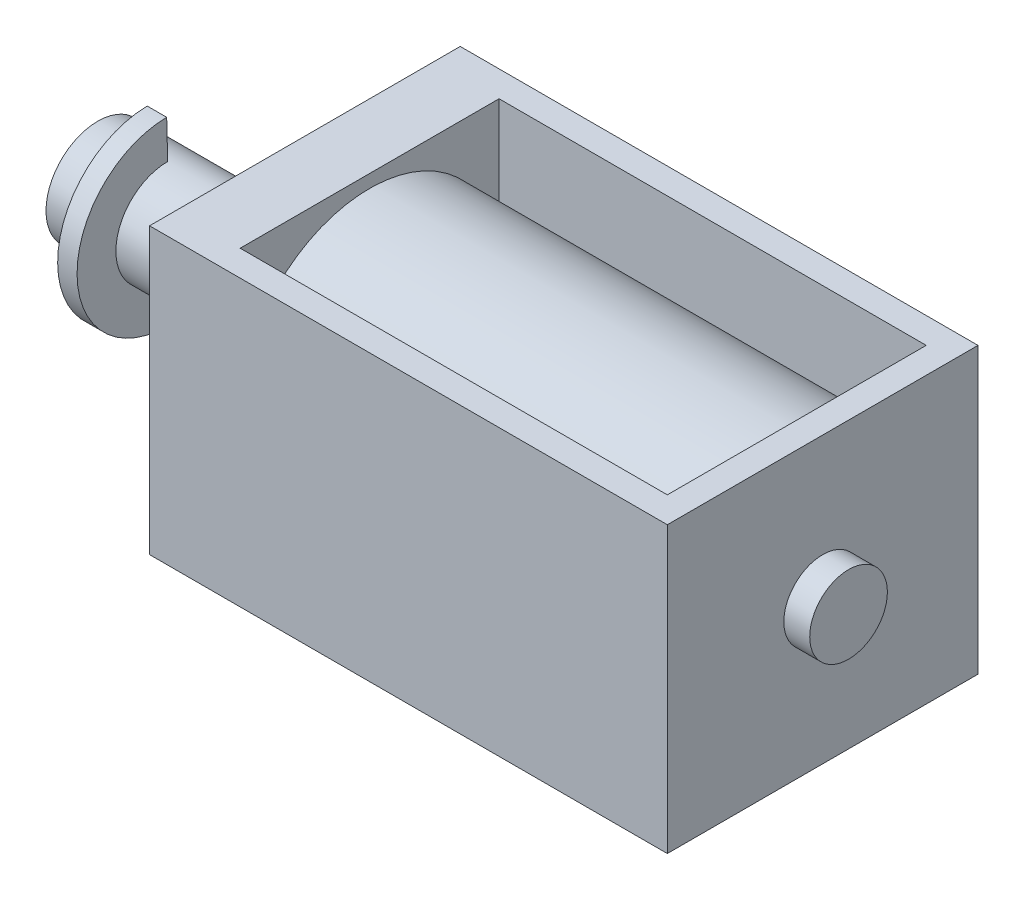
ISO-10303-21;
HEADER;
FILE_DESCRIPTION(('STEP AP214'),'2;1');
FILE_NAME('part.step','',(''),(''),'','','');
FILE_SCHEMA(('AUTOMOTIVE_DESIGN { 1 0 10303 214 1 1 1 1 }'));
ENDSEC;
DATA;
#1=APPLICATION_CONTEXT('core data for automotive mechanical design processes');
#2=APPLICATION_PROTOCOL_DEFINITION('international standard','automotive_design',2000,#1);
#3=PRODUCT_CONTEXT('',#1,'mechanical');
#4=PRODUCT('Part','Part','',(#3));
#5=PRODUCT_RELATED_PRODUCT_CATEGORY('part','',(#4));
#6=PRODUCT_DEFINITION_FORMATION('','',#4);
#7=PRODUCT_DEFINITION_CONTEXT('part definition',#1,'design');
#8=PRODUCT_DEFINITION('design','',#6,#7);
#9=PRODUCT_DEFINITION_SHAPE('','',#8);
#10=(LENGTH_UNIT() NAMED_UNIT(*) SI_UNIT(.MILLI.,.METRE.));
#11=(NAMED_UNIT(*) PLANE_ANGLE_UNIT() SI_UNIT($,.RADIAN.));
#12=(NAMED_UNIT(*) SI_UNIT($,.STERADIAN.) SOLID_ANGLE_UNIT());
#13=UNCERTAINTY_MEASURE_WITH_UNIT(LENGTH_MEASURE(1.E-05),#10,'distance_accuracy_value','');
#14=(GEOMETRIC_REPRESENTATION_CONTEXT(3) GLOBAL_UNCERTAINTY_ASSIGNED_CONTEXT((#13)) GLOBAL_UNIT_ASSIGNED_CONTEXT((#10,
#11,#12)) REPRESENTATION_CONTEXT('',''));
#15=CARTESIAN_POINT('',(0.,0.,0.));
#16=DIRECTION('',(0.,0.,1.));
#17=DIRECTION('',(1.,0.,0.));
#18=AXIS2_PLACEMENT_3D('',#15,#16,#17);
#19=CARTESIAN_POINT('',(19.,0.,-11.));
#20=DIRECTION('',(1.,0.,0.));
#21=DIRECTION('',(0.,0.,-1.));
#22=AXIS2_PLACEMENT_3D('',#19,#20,#21);
#23=PLANE('',#22);
#24=CARTESIAN_POINT('',(19.0000000000055,5.5,-6.));
#25=DIRECTION('',(1.,0.,0.));
#26=DIRECTION('',(0.,0.,-1.));
#27=AXIS2_PLACEMENT_3D('',#24,#25,#26);
#28=CIRCLE('',#27,5.);
#29=CARTESIAN_POINT('',(19.0000000000055,5.5,-11.));
#30=VERTEX_POINT('',#29);
#31=EDGE_CURVE('E11',#30,#30,#28,.T.);
#32=ORIENTED_EDGE('',*,*,#31,.T.);
#33=EDGE_LOOP('',(#32));
#34=FACE_BOUND('',#33,.T.);
#35=ADVANCED_FACE('F47',(#34),#23,.T.);
#36=CARTESIAN_POINT('',(2.5,5.5,-6.));
#37=DIRECTION('',(1.,0.,0.));
#38=DIRECTION('',(0.,0.,-1.));
#39=AXIS2_PLACEMENT_3D('',#36,#37,#38);
#40=PLANE('',#39);
#41=CARTESIAN_POINT('',(2.5,5.5,-6.));
#42=DIRECTION('',(1.,0.,0.));
#43=DIRECTION('',(0.,0.,-1.));
#44=AXIS2_PLACEMENT_3D('',#41,#42,#43);
#45=CIRCLE('',#44,5.);
#46=CARTESIAN_POINT('',(2.5,5.5,-11.));
#47=VERTEX_POINT('',#46);
#48=EDGE_CURVE('E53',#47,#47,#45,.T.);
#49=ORIENTED_EDGE('',*,*,#48,.F.);
#50=EDGE_LOOP('',(#49));
#51=FACE_BOUND('',#50,.T.);
#52=ADVANCED_FACE('F63',(#51),#40,.F.);
#53=CARTESIAN_POINT('',(500000.,5.5,-6.00000000006505));
#54=DIRECTION('',(-1.,0.,0.));
#55=DIRECTION('',(0.,0.,1.));
#56=AXIS2_PLACEMENT_3D('',#53,#54,#55);
#57=CYLINDRICAL_SURFACE('',#56,5.);
#58=ORIENTED_EDGE('',*,*,#48,.T.);
#59=EDGE_LOOP('',(#58));
#60=FACE_BOUND('',#59,.T.);
#61=ORIENTED_EDGE('',*,*,#31,.F.);
#62=EDGE_LOOP('',(#61));
#63=FACE_BOUND('',#62,.T.);
#64=ADVANCED_FACE('F60',(#60,#63),#57,.T.);
#65=CLOSED_SHELL('',(#35,#52,#64));
#66=MANIFOLD_SOLID_BREP('B2',#65);
#67=CARTESIAN_POINT('',(20.,11.,0.));
#68=DIRECTION('',(-1.,0.,0.));
#69=DIRECTION('',(0.,0.,1.));
#70=AXIS2_PLACEMENT_3D('',#67,#68,#69);
#71=PLANE('',#70);
#72=DIRECTION('',(0.,0.,-1.));
#73=VECTOR('',#72,1.);
#74=CARTESIAN_POINT('',(20.,0.,0.));
#75=LINE('',#74,#73);
#76=CARTESIAN_POINT('',(20.,0.,0.));
#77=VERTEX_POINT('',#76);
#78=CARTESIAN_POINT('',(20.,0.,-12.));
#79=VERTEX_POINT('',#78);
#80=EDGE_CURVE('E307',#77,#79,#75,.T.);
#81=ORIENTED_EDGE('',*,*,#80,.T.);
#82=DIRECTION('',(0.,-1.,0.));
#83=VECTOR('',#82,1.);
#84=CARTESIAN_POINT('',(20.,11.,-12.));
#85=LINE('',#84,#83);
#86=CARTESIAN_POINT('',(20.,11.,-12.));
#87=VERTEX_POINT('',#86);
#88=EDGE_CURVE('E313',#87,#79,#85,.T.);
#89=ORIENTED_EDGE('',*,*,#88,.F.);
#90=DIRECTION('',(0.,0.,-1.));
#91=VECTOR('',#90,1.);
#92=CARTESIAN_POINT('',(20.,11.,0.));
#93=LINE('',#92,#91);
#94=CARTESIAN_POINT('',(20.,11.,0.));
#95=VERTEX_POINT('',#94);
#96=EDGE_CURVE('E294',#95,#87,#93,.T.);
#97=ORIENTED_EDGE('',*,*,#96,.F.);
#98=DIRECTION('',(0.,-1.,0.));
#99=VECTOR('',#98,1.);
#100=CARTESIAN_POINT('',(20.,11.,0.));
#101=LINE('',#100,#99);
#102=EDGE_CURVE('E316',#95,#77,#101,.T.);
#103=ORIENTED_EDGE('',*,*,#102,.T.);
#104=EDGE_LOOP('',(#81,#89,#97,#103));
#105=FACE_BOUND('',#104,.T.);
#106=CARTESIAN_POINT('',(20.,5.5,-6.));
#107=DIRECTION('',(-1.,0.,0.));
#108=DIRECTION('',(0.,0.,1.));
#109=AXIS2_PLACEMENT_3D('',#106,#107,#108);
#110=CIRCLE('',#109,1.5);
#111=CARTESIAN_POINT('',(20.,5.5,-4.5));
#112=VERTEX_POINT('',#111);
#113=EDGE_CURVE('E45',#112,#112,#110,.F.);
#114=ORIENTED_EDGE('',*,*,#113,.F.);
#115=EDGE_LOOP('',(#114));
#116=FACE_BOUND('',#115,.T.);
#117=ADVANCED_FACE('F91',(#105,#116),#71,.F.);
#118=CARTESIAN_POINT('',(0.,11.,0.));
#119=DIRECTION('',(1.,0.,0.));
#120=DIRECTION('',(0.,0.,-1.));
#121=AXIS2_PLACEMENT_3D('',#118,#119,#120);
#122=PLANE('',#121);
#123=DIRECTION('',(0.,0.,1.));
#124=VECTOR('',#123,1.);
#125=CARTESIAN_POINT('',(0.,0.,0.));
#126=LINE('',#125,#124);
#127=CARTESIAN_POINT('',(0.,0.,-12.));
#128=VERTEX_POINT('',#127);
#129=CARTESIAN_POINT('',(0.,0.,0.));
#130=VERTEX_POINT('',#129);
#131=EDGE_CURVE('E277',#128,#130,#126,.T.);
#132=ORIENTED_EDGE('',*,*,#131,.T.);
#133=DIRECTION('',(0.,-1.,0.));
#134=VECTOR('',#133,1.);
#135=CARTESIAN_POINT('',(0.,11.,0.));
#136=LINE('',#135,#134);
#137=CARTESIAN_POINT('',(0.,11.,0.));
#138=VERTEX_POINT('',#137);
#139=EDGE_CURVE('E319',#138,#130,#136,.T.);
#140=ORIENTED_EDGE('',*,*,#139,.F.);
#141=DIRECTION('',(0.,0.,1.));
#142=VECTOR('',#141,1.);
#143=CARTESIAN_POINT('',(0.,11.,0.));
#144=LINE('',#143,#142);
#145=CARTESIAN_POINT('',(0.,11.,-12.));
#146=VERTEX_POINT('',#145);
#147=EDGE_CURVE('E286',#146,#138,#144,.T.);
#148=ORIENTED_EDGE('',*,*,#147,.F.);
#149=DIRECTION('',(0.,-1.,0.));
#150=VECTOR('',#149,1.);
#151=CARTESIAN_POINT('',(0.,11.,-12.));
#152=LINE('',#151,#150);
#153=EDGE_CURVE('E300',#146,#128,#152,.T.);
#154=ORIENTED_EDGE('',*,*,#153,.T.);
#155=EDGE_LOOP('',(#132,#140,#148,#154));
#156=FACE_BOUND('',#155,.T.);
#157=CARTESIAN_POINT('',(0.,5.5,-6.));
#158=DIRECTION('',(1.,0.,0.));
#159=DIRECTION('',(0.,0.,-1.));
#160=AXIS2_PLACEMENT_3D('',#157,#158,#159);
#161=CIRCLE('',#160,2.);
#162=CARTESIAN_POINT('',(0.,5.5,-8.));
#163=VERTEX_POINT('',#162);
#164=EDGE_CURVE('E99',#163,#163,#161,.F.);
#165=ORIENTED_EDGE('',*,*,#164,.F.);
#166=EDGE_LOOP('',(#165));
#167=FACE_BOUND('',#166,.T.);
#168=ADVANCED_FACE('F93',(#156,#167),#122,.F.);
#169=CARTESIAN_POINT('',(0.,11.,0.));
#170=DIRECTION('',(0.,0.,-1.));
#171=DIRECTION('',(-1.,0.,0.));
#172=AXIS2_PLACEMENT_3D('',#169,#170,#171);
#173=PLANE('',#172);
#174=DIRECTION('',(1.,0.,0.));
#175=VECTOR('',#174,1.);
#176=CARTESIAN_POINT('',(0.,0.,0.));
#177=LINE('',#176,#175);
#178=EDGE_CURVE('E304',#130,#77,#177,.T.);
#179=ORIENTED_EDGE('',*,*,#178,.T.);
#180=ORIENTED_EDGE('',*,*,#102,.F.);
#181=DIRECTION('',(1.,0.,0.));
#182=VECTOR('',#181,1.);
#183=CARTESIAN_POINT('',(0.,11.,0.));
#184=LINE('',#183,#182);
#185=EDGE_CURVE('E290',#138,#95,#184,.T.);
#186=ORIENTED_EDGE('',*,*,#185,.F.);
#187=ORIENTED_EDGE('',*,*,#139,.T.);
#188=EDGE_LOOP('',(#179,#180,#186,#187));
#189=FACE_BOUND('',#188,.T.);
#190=ADVANCED_FACE('F329',(#189),#173,.F.);
#191=CARTESIAN_POINT('',(0.,11.,-12.));
#192=DIRECTION('',(0.,0.,1.));
#193=DIRECTION('',(1.,0.,0.));
#194=AXIS2_PLACEMENT_3D('',#191,#192,#193);
#195=PLANE('',#194);
#196=DIRECTION('',(-1.,0.,0.));
#197=VECTOR('',#196,1.);
#198=CARTESIAN_POINT('',(0.,0.,-12.));
#199=LINE('',#198,#197);
#200=EDGE_CURVE('E291',#79,#128,#199,.T.);
#201=ORIENTED_EDGE('',*,*,#200,.T.);
#202=ORIENTED_EDGE('',*,*,#153,.F.);
#203=DIRECTION('',(-1.,0.,0.));
#204=VECTOR('',#203,1.);
#205=CARTESIAN_POINT('',(0.,11.,-12.));
#206=LINE('',#205,#204);
#207=EDGE_CURVE('E297',#87,#146,#206,.T.);
#208=ORIENTED_EDGE('',*,*,#207,.F.);
#209=ORIENTED_EDGE('',*,*,#88,.T.);
#210=EDGE_LOOP('',(#201,#202,#208,#209));
#211=FACE_BOUND('',#210,.T.);
#212=ADVANCED_FACE('F335',(#211),#195,.F.);
#213=CARTESIAN_POINT('',(0.,11.,0.));
#214=DIRECTION('',(0.,-1.,0.));
#215=DIRECTION('',(0.,0.,-1.));
#216=AXIS2_PLACEMENT_3D('',#213,#214,#215);
#217=PLANE('',#216);
#218=DIRECTION('',(1.,0.,0.));
#219=VECTOR('',#218,1.);
#220=CARTESIAN_POINT('',(2.5,11.,-1.));
#221=LINE('',#220,#219);
#222=CARTESIAN_POINT('',(2.5,11.,-1.));
#223=VERTEX_POINT('',#222);
#224=CARTESIAN_POINT('',(19.,11.,-1.));
#225=VERTEX_POINT('',#224);
#226=EDGE_CURVE('E263',#223,#225,#221,.T.);
#227=ORIENTED_EDGE('',*,*,#226,.F.);
#228=DIRECTION('',(0.,0.,1.));
#229=VECTOR('',#228,1.);
#230=CARTESIAN_POINT('',(2.5,11.,-11.));
#231=LINE('',#230,#229);
#232=CARTESIAN_POINT('',(2.5,11.,-11.));
#233=VERTEX_POINT('',#232);
#234=EDGE_CURVE('E246',#233,#223,#231,.T.);
#235=ORIENTED_EDGE('',*,*,#234,.F.);
#236=DIRECTION('',(-1.,0.,0.));
#237=VECTOR('',#236,1.);
#238=CARTESIAN_POINT('',(2.5,11.,-11.));
#239=LINE('',#238,#237);
#240=CARTESIAN_POINT('',(19.,11.,-11.));
#241=VERTEX_POINT('',#240);
#242=EDGE_CURVE('E251',#241,#233,#239,.T.);
#243=ORIENTED_EDGE('',*,*,#242,.F.);
#244=DIRECTION('',(0.,0.,-1.));
#245=VECTOR('',#244,1.);
#246=CARTESIAN_POINT('',(19.,11.,-11.));
#247=LINE('',#246,#245);
#248=EDGE_CURVE('E267',#225,#241,#247,.T.);
#249=ORIENTED_EDGE('',*,*,#248,.F.);
#250=EDGE_LOOP('',(#227,#235,#243,#249));
#251=FACE_BOUND('',#250,.T.);
#252=ORIENTED_EDGE('',*,*,#147,.T.);
#253=ORIENTED_EDGE('',*,*,#185,.T.);
#254=ORIENTED_EDGE('',*,*,#96,.T.);
#255=ORIENTED_EDGE('',*,*,#207,.T.);
#256=EDGE_LOOP('',(#252,#253,#254,#255));
#257=FACE_BOUND('',#256,.T.);
#258=ADVANCED_FACE('F350',(#251,#257),#217,.F.);
#259=CARTESIAN_POINT('',(0.,0.,0.));
#260=DIRECTION('',(0.,-1.,0.));
#261=DIRECTION('',(0.,0.,-1.));
#262=AXIS2_PLACEMENT_3D('',#259,#260,#261);
#263=PLANE('',#262);
#264=DIRECTION('',(0.,0.,1.));
#265=VECTOR('',#264,1.);
#266=CARTESIAN_POINT('',(2.5,0.,-11.));
#267=LINE('',#266,#265);
#268=CARTESIAN_POINT('',(2.5,0.,-11.));
#269=VERTEX_POINT('',#268);
#270=CARTESIAN_POINT('',(2.5,0.,-1.));
#271=VERTEX_POINT('',#270);
#272=EDGE_CURVE('E247',#269,#271,#267,.T.);
#273=ORIENTED_EDGE('',*,*,#272,.T.);
#274=DIRECTION('',(1.,0.,0.));
#275=VECTOR('',#274,1.);
#276=CARTESIAN_POINT('',(2.5,0.,-1.));
#277=LINE('',#276,#275);
#278=CARTESIAN_POINT('',(19.,0.,-1.));
#279=VERTEX_POINT('',#278);
#280=EDGE_CURVE('E250',#271,#279,#277,.T.);
#281=ORIENTED_EDGE('',*,*,#280,.T.);
#282=DIRECTION('',(0.,0.,-1.));
#283=VECTOR('',#282,1.);
#284=CARTESIAN_POINT('',(19.,0.,-11.));
#285=LINE('',#284,#283);
#286=CARTESIAN_POINT('',(19.,0.,-11.));
#287=VERTEX_POINT('',#286);
#288=EDGE_CURVE('E254',#279,#287,#285,.T.);
#289=ORIENTED_EDGE('',*,*,#288,.T.);
#290=DIRECTION('',(-1.,0.,0.));
#291=VECTOR('',#290,1.);
#292=CARTESIAN_POINT('',(2.5,0.,-11.));
#293=LINE('',#292,#291);
#294=EDGE_CURVE('E257',#287,#269,#293,.T.);
#295=ORIENTED_EDGE('',*,*,#294,.T.);
#296=EDGE_LOOP('',(#273,#281,#289,#295));
#297=FACE_BOUND('',#296,.T.);
#298=ORIENTED_EDGE('',*,*,#131,.F.);
#299=ORIENTED_EDGE('',*,*,#200,.F.);
#300=ORIENTED_EDGE('',*,*,#80,.F.);
#301=ORIENTED_EDGE('',*,*,#178,.F.);
#302=EDGE_LOOP('',(#298,#299,#300,#301));
#303=FACE_BOUND('',#302,.T.);
#304=ADVANCED_FACE('F345',(#297,#303),#263,.T.);
#305=CARTESIAN_POINT('',(2.5,0.,-11.));
#306=DIRECTION('',(-1.,0.,0.));
#307=DIRECTION('',(0.,0.,1.));
#308=AXIS2_PLACEMENT_3D('',#305,#306,#307);
#309=PLANE('',#308);
#310=ORIENTED_EDGE('',*,*,#234,.T.);
#311=DIRECTION('',(0.,1.,0.));
#312=VECTOR('',#311,1.);
#313=CARTESIAN_POINT('',(2.5,0.,-1.));
#314=LINE('',#313,#312);
#315=EDGE_CURVE('E260',#271,#223,#314,.T.);
#316=ORIENTED_EDGE('',*,*,#315,.F.);
#317=ORIENTED_EDGE('',*,*,#272,.F.);
#318=DIRECTION('',(0.,1.,0.));
#319=VECTOR('',#318,1.);
#320=CARTESIAN_POINT('',(2.5,0.,-11.));
#321=LINE('',#320,#319);
#322=EDGE_CURVE('E274',#269,#233,#321,.T.);
#323=ORIENTED_EDGE('',*,*,#322,.T.);
#324=EDGE_LOOP('',(#310,#316,#317,#323));
#325=FACE_BOUND('',#324,.T.);
#326=ADVANCED_FACE('F381',(#325),#309,.F.);
#327=CARTESIAN_POINT('',(2.5,0.,-11.));
#328=DIRECTION('',(0.,0.,-1.));
#329=DIRECTION('',(-1.,0.,0.));
#330=AXIS2_PLACEMENT_3D('',#327,#328,#329);
#331=PLANE('',#330);
#332=ORIENTED_EDGE('',*,*,#242,.T.);
#333=ORIENTED_EDGE('',*,*,#322,.F.);
#334=ORIENTED_EDGE('',*,*,#294,.F.);
#335=DIRECTION('',(0.,1.,0.));
#336=VECTOR('',#335,1.);
#337=CARTESIAN_POINT('',(19.,0.,-11.));
#338=LINE('',#337,#336);
#339=EDGE_CURVE('E278',#287,#241,#338,.T.);
#340=ORIENTED_EDGE('',*,*,#339,.T.);
#341=EDGE_LOOP('',(#332,#333,#334,#340));
#342=FACE_BOUND('',#341,.T.);
#343=ADVANCED_FACE('F377',(#342),#331,.F.);
#344=CARTESIAN_POINT('',(19.,0.,-11.));
#345=DIRECTION('',(1.,0.,0.));
#346=DIRECTION('',(0.,0.,-1.));
#347=AXIS2_PLACEMENT_3D('',#344,#345,#346);
#348=PLANE('',#347);
#349=ORIENTED_EDGE('',*,*,#248,.T.);
#350=ORIENTED_EDGE('',*,*,#339,.F.);
#351=ORIENTED_EDGE('',*,*,#288,.F.);
#352=DIRECTION('',(0.,1.,0.));
#353=VECTOR('',#352,1.);
#354=CARTESIAN_POINT('',(19.,0.,-1.));
#355=LINE('',#354,#353);
#356=EDGE_CURVE('E281',#279,#225,#355,.T.);
#357=ORIENTED_EDGE('',*,*,#356,.T.);
#358=EDGE_LOOP('',(#349,#350,#351,#357));
#359=FACE_BOUND('',#358,.T.);
#360=ADVANCED_FACE('F380',(#359),#348,.F.);
#361=CARTESIAN_POINT('',(2.5,0.,-1.));
#362=DIRECTION('',(0.,0.,1.));
#363=DIRECTION('',(1.,0.,0.));
#364=AXIS2_PLACEMENT_3D('',#361,#362,#363);
#365=PLANE('',#364);
#366=ORIENTED_EDGE('',*,*,#226,.T.);
#367=ORIENTED_EDGE('',*,*,#356,.F.);
#368=ORIENTED_EDGE('',*,*,#280,.F.);
#369=ORIENTED_EDGE('',*,*,#315,.T.);
#370=EDGE_LOOP('',(#366,#367,#368,#369));
#371=FACE_BOUND('',#370,.T.);
#372=ADVANCED_FACE('F376',(#371),#365,.F.);
#373=CARTESIAN_POINT('',(-8.,5.5,-6.));
#374=DIRECTION('',(1.,0.,0.));
#375=DIRECTION('',(0.,0.,-1.));
#376=AXIS2_PLACEMENT_3D('',#373,#374,#375);
#377=CYLINDRICAL_SURFACE('',#376,2.);
#378=DIRECTION('',(1.,0.,0.));
#379=VECTOR('',#378,1.);
#380=CARTESIAN_POINT('',(-6.05,3.5,-6.));
#381=LINE('',#380,#379);
#382=CARTESIAN_POINT('',(-6.05,3.5,-6.));
#383=VERTEX_POINT('',#382);
#384=CARTESIAN_POINT('',(-5.3,3.5,-6.));
#385=VERTEX_POINT('',#384);
#386=EDGE_CURVE('E109',#383,#385,#381,.T.);
#387=ORIENTED_EDGE('',*,*,#386,.F.);
#388=CARTESIAN_POINT('',(-6.05,5.5,-6.));
#389=DIRECTION('',(1.,0.,0.));
#390=DIRECTION('',(0.,0.,1.));
#391=AXIS2_PLACEMENT_3D('',#388,#389,#390);
#392=CIRCLE('',#391,2.);
#393=CARTESIAN_POINT('',(-6.05,7.5,-6.));
#394=VERTEX_POINT('',#393);
#395=EDGE_CURVE('E117',#394,#383,#392,.T.);
#396=ORIENTED_EDGE('',*,*,#395,.F.);
#397=DIRECTION('',(1.,0.,0.));
#398=VECTOR('',#397,1.);
#399=CARTESIAN_POINT('',(-6.05,7.5,-6.));
#400=LINE('',#399,#398);
#401=CARTESIAN_POINT('',(-5.3,7.5,-6.));
#402=VERTEX_POINT('',#401);
#403=EDGE_CURVE('E219',#394,#402,#400,.T.);
#404=ORIENTED_EDGE('',*,*,#403,.T.);
#405=CARTESIAN_POINT('',(-5.3,5.5,-6.));
#406=DIRECTION('',(1.,0.,0.));
#407=DIRECTION('',(0.,0.,1.));
#408=AXIS2_PLACEMENT_3D('',#405,#406,#407);
#409=CIRCLE('',#408,2.);
#410=EDGE_CURVE('E223',#402,#385,#409,.T.);
#411=ORIENTED_EDGE('',*,*,#410,.T.);
#412=EDGE_LOOP('',(#387,#396,#404,#411));
#413=FACE_BOUND('',#412,.T.);
#414=CARTESIAN_POINT('',(-8.,5.5,-6.));
#415=DIRECTION('',(-1.,0.,0.));
#416=DIRECTION('',(0.,0.,1.));
#417=AXIS2_PLACEMENT_3D('',#414,#415,#416);
#418=CIRCLE('',#417,2.);
#419=CARTESIAN_POINT('',(-8.,5.5,-4.));
#420=VERTEX_POINT('',#419);
#421=EDGE_CURVE('E242',#420,#420,#418,.T.);
#422=ORIENTED_EDGE('',*,*,#421,.F.);
#423=EDGE_LOOP('',(#422));
#424=FACE_BOUND('',#423,.T.);
#425=ORIENTED_EDGE('',*,*,#164,.T.);
#426=EDGE_LOOP('',(#425));
#427=FACE_BOUND('',#426,.T.);
#428=ADVANCED_FACE('F326',(#413,#424,#427),#377,.T.);
#429=CARTESIAN_POINT('',(-8.,5.5,-6.));
#430=DIRECTION('',(-1.,0.,0.));
#431=DIRECTION('',(0.,0.,1.));
#432=AXIS2_PLACEMENT_3D('',#429,#430,#431);
#433=PLANE('',#432);
#434=ORIENTED_EDGE('',*,*,#421,.T.);
#435=EDGE_LOOP('',(#434));
#436=FACE_BOUND('',#435,.T.);
#437=ADVANCED_FACE('F360',(#436),#433,.T.);
#438=CARTESIAN_POINT('',(21.,5.5,-6.));
#439=DIRECTION('',(-1.,0.,0.));
#440=DIRECTION('',(0.,0.,1.));
#441=AXIS2_PLACEMENT_3D('',#438,#439,#440);
#442=CYLINDRICAL_SURFACE('',#441,1.5);
#443=CARTESIAN_POINT('',(21.,5.5,-6.));
#444=DIRECTION('',(1.,0.,0.));
#445=DIRECTION('',(0.,0.,-1.));
#446=AXIS2_PLACEMENT_3D('',#443,#444,#445);
#447=CIRCLE('',#446,1.5);
#448=CARTESIAN_POINT('',(21.,5.5,-7.5));
#449=VERTEX_POINT('',#448);
#450=EDGE_CURVE('E239',#449,#449,#447,.T.);
#451=ORIENTED_EDGE('',*,*,#450,.F.);
#452=EDGE_LOOP('',(#451));
#453=FACE_BOUND('',#452,.T.);
#454=ORIENTED_EDGE('',*,*,#113,.T.);
#455=EDGE_LOOP('',(#454));
#456=FACE_BOUND('',#455,.T.);
#457=ADVANCED_FACE('F357',(#453,#456),#442,.T.);
#458=CARTESIAN_POINT('',(21.,5.5,-6.));
#459=DIRECTION('',(1.,0.,0.));
#460=DIRECTION('',(0.,0.,-1.));
#461=AXIS2_PLACEMENT_3D('',#458,#459,#460);
#462=PLANE('',#461);
#463=ORIENTED_EDGE('',*,*,#450,.T.);
#464=EDGE_LOOP('',(#463));
#465=FACE_BOUND('',#464,.T.);
#466=ADVANCED_FACE('F359',(#465),#462,.T.);
#467=CARTESIAN_POINT('',(-6.05,3.5,-6.));
#468=DIRECTION('',(0.,0.,1.));
#469=DIRECTION('',(1.,0.,0.));
#470=AXIS2_PLACEMENT_3D('',#467,#468,#469);
#471=PLANE('',#470);
#472=DIRECTION('',(0.,-1.,0.));
#473=VECTOR('',#472,1.);
#474=CARTESIAN_POINT('',(-5.3,3.5,-6.));
#475=LINE('',#474,#473);
#476=CARTESIAN_POINT('',(-5.3,2.,-6.));
#477=VERTEX_POINT('',#476);
#478=EDGE_CURVE('E204',#385,#477,#475,.T.);
#479=ORIENTED_EDGE('',*,*,#478,.T.);
#480=DIRECTION('',(1.,0.,0.));
#481=VECTOR('',#480,1.);
#482=CARTESIAN_POINT('',(-6.05,2.,-6.));
#483=LINE('',#482,#481);
#484=CARTESIAN_POINT('',(-6.05,2.,-6.));
#485=VERTEX_POINT('',#484);
#486=EDGE_CURVE('E201',#485,#477,#483,.T.);
#487=ORIENTED_EDGE('',*,*,#486,.F.);
#488=DIRECTION('',(0.,-1.,0.));
#489=VECTOR('',#488,1.);
#490=CARTESIAN_POINT('',(-6.05,3.5,-6.));
#491=LINE('',#490,#489);
#492=EDGE_CURVE('E191',#383,#485,#491,.T.);
#493=ORIENTED_EDGE('',*,*,#492,.F.);
#494=ORIENTED_EDGE('',*,*,#386,.T.);
#495=EDGE_LOOP('',(#479,#487,#493,#494));
#496=FACE_BOUND('',#495,.T.);
#497=ADVANCED_FACE('F202',(#496),#471,.F.);
#498=CARTESIAN_POINT('',(-6.05,5.5,-6.));
#499=DIRECTION('',(1.,0.,0.));
#500=DIRECTION('',(0.,0.,-1.));
#501=AXIS2_PLACEMENT_3D('',#498,#499,#500);
#502=CYLINDRICAL_SURFACE('',#501,3.5);
#503=CARTESIAN_POINT('',(-5.3,5.5,-6.));
#504=DIRECTION('',(-1.,0.,0.));
#505=DIRECTION('',(0.,0.,1.));
#506=AXIS2_PLACEMENT_3D('',#503,#504,#505);
#507=CIRCLE('',#506,3.5);
#508=CARTESIAN_POINT('',(-5.3,8.99978869200331,-5.96154078360436));
#509=VERTEX_POINT('',#508);
#510=EDGE_CURVE('E228',#477,#509,#507,.T.);
#511=ORIENTED_EDGE('',*,*,#510,.T.);
#512=DIRECTION('',(1.,0.,0.));
#513=VECTOR('',#512,1.);
#514=CARTESIAN_POINT('',(-6.05,8.99978869200331,-5.96154078360436));
#515=LINE('',#514,#513);
#516=CARTESIAN_POINT('',(-6.05,8.99978869200331,-5.96154078360436));
#517=VERTEX_POINT('',#516);
#518=EDGE_CURVE('E208',#517,#509,#515,.T.);
#519=ORIENTED_EDGE('',*,*,#518,.F.);
#520=CARTESIAN_POINT('',(-6.05,5.5,-6.));
#521=DIRECTION('',(-1.,0.,0.));
#522=DIRECTION('',(0.,0.,1.));
#523=AXIS2_PLACEMENT_3D('',#520,#521,#522);
#524=CIRCLE('',#523,3.5);
#525=EDGE_CURVE('E195',#485,#517,#524,.T.);
#526=ORIENTED_EDGE('',*,*,#525,.F.);
#527=ORIENTED_EDGE('',*,*,#486,.T.);
#528=EDGE_LOOP('',(#511,#519,#526,#527));
#529=FACE_BOUND('',#528,.T.);
#530=ADVANCED_FACE('F210',(#529),#502,.T.);
#531=CARTESIAN_POINT('',(-6.05,7.5,-6.));
#532=DIRECTION('',(0.,-0.0256346631075954,0.99967137802748));
#533=DIRECTION('',(0.,-0.99967137802748,-0.0256346631075954));
#534=AXIS2_PLACEMENT_3D('',#531,#532,#533);
#535=PLANE('',#534);
#536=DIRECTION('',(0.,-0.99967137802748,-0.0256346631075954));
#537=VECTOR('',#536,1.);
#538=CARTESIAN_POINT('',(-5.3,7.5,-6.));
#539=LINE('',#538,#537);
#540=EDGE_CURVE('E230',#509,#402,#539,.T.);
#541=ORIENTED_EDGE('',*,*,#540,.T.);
#542=ORIENTED_EDGE('',*,*,#403,.F.);
#543=DIRECTION('',(0.,-0.99967137802748,-0.0256346631075954));
#544=VECTOR('',#543,1.);
#545=CARTESIAN_POINT('',(-6.05,7.5,-6.));
#546=LINE('',#545,#544);
#547=EDGE_CURVE('E214',#517,#394,#546,.T.);
#548=ORIENTED_EDGE('',*,*,#547,.F.);
#549=ORIENTED_EDGE('',*,*,#518,.T.);
#550=EDGE_LOOP('',(#541,#542,#548,#549));
#551=FACE_BOUND('',#550,.T.);
#552=ADVANCED_FACE('F471',(#551),#535,.F.);
#553=CARTESIAN_POINT('',(-6.05,5.5,-6.));
#554=DIRECTION('',(-1.,0.,0.));
#555=DIRECTION('',(0.,0.,1.));
#556=AXIS2_PLACEMENT_3D('',#553,#554,#555);
#557=PLANE('',#556);
#558=ORIENTED_EDGE('',*,*,#395,.T.);
#559=ORIENTED_EDGE('',*,*,#492,.T.);
#560=ORIENTED_EDGE('',*,*,#525,.T.);
#561=ORIENTED_EDGE('',*,*,#547,.T.);
#562=EDGE_LOOP('',(#558,#559,#560,#561));
#563=FACE_BOUND('',#562,.T.);
#564=ADVANCED_FACE('F193',(#563),#557,.T.);
#565=CARTESIAN_POINT('',(-5.3,5.5,-6.));
#566=DIRECTION('',(-1.,0.,0.));
#567=DIRECTION('',(0.,0.,1.));
#568=AXIS2_PLACEMENT_3D('',#565,#566,#567);
#569=PLANE('',#568);
#570=ORIENTED_EDGE('',*,*,#410,.F.);
#571=ORIENTED_EDGE('',*,*,#540,.F.);
#572=ORIENTED_EDGE('',*,*,#510,.F.);
#573=ORIENTED_EDGE('',*,*,#478,.F.);
#574=EDGE_LOOP('',(#570,#571,#572,#573));
#575=FACE_BOUND('',#574,.T.);
#576=ADVANCED_FACE('F489',(#575),#569,.F.);
#577=CLOSED_SHELL('',(#117,#168,#190,#212,#258,#304,#326,#343,#360,#372,#428,#437,#457,#466,
#497,#530,#552,#564,#576));
#578=MANIFOLD_SOLID_BREP('B6',#577);
#579=ADVANCED_BREP_SHAPE_REPRESENTATION('',(#18,#66,#578),#14);
#580=SHAPE_DEFINITION_REPRESENTATION(#9,#579);
ENDSEC;
END-ISO-10303-21;
